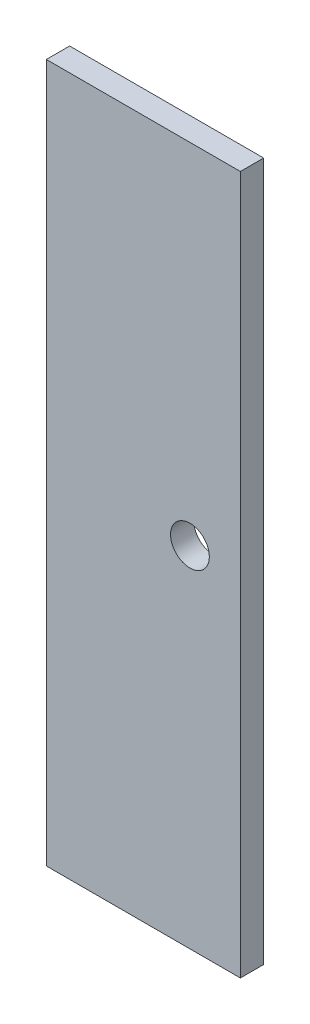
ISO-10303-21;
HEADER;
FILE_DESCRIPTION(('STEP AP214'),'2;1');
FILE_NAME('part.step','',(''),(''),'','','');
FILE_SCHEMA(('AUTOMOTIVE_DESIGN { 1 0 10303 214 1 1 1 1 }'));
ENDSEC;
DATA;
#1=APPLICATION_CONTEXT('core data for automotive mechanical design processes');
#2=APPLICATION_PROTOCOL_DEFINITION('international standard','automotive_design',2000,#1);
#3=PRODUCT_CONTEXT('',#1,'mechanical');
#4=PRODUCT('Part','Part','',(#3));
#5=PRODUCT_RELATED_PRODUCT_CATEGORY('part','',(#4));
#6=PRODUCT_DEFINITION_FORMATION('','',#4);
#7=PRODUCT_DEFINITION_CONTEXT('part definition',#1,'design');
#8=PRODUCT_DEFINITION('design','',#6,#7);
#9=PRODUCT_DEFINITION_SHAPE('','',#8);
#10=(LENGTH_UNIT() NAMED_UNIT(*) SI_UNIT(.MILLI.,.METRE.));
#11=(NAMED_UNIT(*) PLANE_ANGLE_UNIT() SI_UNIT($,.RADIAN.));
#12=(NAMED_UNIT(*) SI_UNIT($,.STERADIAN.) SOLID_ANGLE_UNIT());
#13=UNCERTAINTY_MEASURE_WITH_UNIT(LENGTH_MEASURE(1.E-05),#10,'distance_accuracy_value','');
#14=(GEOMETRIC_REPRESENTATION_CONTEXT(3) GLOBAL_UNCERTAINTY_ASSIGNED_CONTEXT((#13)) GLOBAL_UNIT_ASSIGNED_CONTEXT((#10,
#11,#12)) REPRESENTATION_CONTEXT('',''));
#15=CARTESIAN_POINT('',(0.,0.,0.));
#16=DIRECTION('',(0.,0.,1.));
#17=DIRECTION('',(1.,0.,0.));
#18=AXIS2_PLACEMENT_3D('',#15,#16,#17);
#19=CARTESIAN_POINT('',(-24.9999999999999,-89.9999999999998,6.));
#20=DIRECTION('',(1.,0.,0.));
#21=DIRECTION('',(0.,0.,-1.));
#22=AXIS2_PLACEMENT_3D('',#19,#20,#21);
#23=PLANE('',#22);
#24=DIRECTION('',(0.,-1.,0.));
#25=VECTOR('',#24,1.);
#26=CARTESIAN_POINT('',(-24.9999999999999,-89.9999999999998,0.));
#27=LINE('',#26,#25);
#28=CARTESIAN_POINT('',(-24.9999999999999,90.0000000000002,0.));
#29=VERTEX_POINT('',#28);
#30=CARTESIAN_POINT('',(-24.9999999999999,-89.9999999999998,0.));
#31=VERTEX_POINT('',#30);
#32=EDGE_CURVE('E98',#29,#31,#27,.T.);
#33=ORIENTED_EDGE('',*,*,#32,.T.);
#34=DIRECTION('',(0.,0.,-1.));
#35=VECTOR('',#34,1.);
#36=CARTESIAN_POINT('',(-24.9999999999999,-89.9999999999998,6.));
#37=LINE('',#36,#35);
#38=CARTESIAN_POINT('',(-24.9999999999999,-89.9999999999998,6.));
#39=VERTEX_POINT('',#38);
#40=EDGE_CURVE('E11',#39,#31,#37,.T.);
#41=ORIENTED_EDGE('',*,*,#40,.F.);
#42=DIRECTION('',(0.,-1.,0.));
#43=VECTOR('',#42,1.);
#44=CARTESIAN_POINT('',(-24.9999999999999,-89.9999999999998,6.));
#45=LINE('',#44,#43);
#46=CARTESIAN_POINT('',(-24.9999999999999,90.0000000000002,6.));
#47=VERTEX_POINT('',#46);
#48=EDGE_CURVE('E85',#47,#39,#45,.T.);
#49=ORIENTED_EDGE('',*,*,#48,.F.);
#50=DIRECTION('',(0.,0.,-1.));
#51=VECTOR('',#50,1.);
#52=CARTESIAN_POINT('',(-24.9999999999999,90.0000000000002,6.));
#53=LINE('',#52,#51);
#54=EDGE_CURVE('E94',#47,#29,#53,.T.);
#55=ORIENTED_EDGE('',*,*,#54,.T.);
#56=EDGE_LOOP('',(#33,#41,#49,#55));
#57=FACE_BOUND('',#56,.T.);
#58=ADVANCED_FACE('F33',(#57),#23,.F.);
#59=CARTESIAN_POINT('',(25.0000000000001,-89.9999999999998,6.));
#60=DIRECTION('',(0.,1.,0.));
#61=DIRECTION('',(0.,0.,1.));
#62=AXIS2_PLACEMENT_3D('',#59,#60,#61);
#63=PLANE('',#62);
#64=DIRECTION('',(1.,0.,0.));
#65=VECTOR('',#64,1.);
#66=CARTESIAN_POINT('',(25.0000000000001,-89.9999999999998,0.));
#67=LINE('',#66,#65);
#68=CARTESIAN_POINT('',(25.0000000000001,-89.9999999999998,0.));
#69=VERTEX_POINT('',#68);
#70=EDGE_CURVE('E89',#31,#69,#67,.T.);
#71=ORIENTED_EDGE('',*,*,#70,.T.);
#72=DIRECTION('',(0.,0.,-1.));
#73=VECTOR('',#72,1.);
#74=CARTESIAN_POINT('',(25.0000000000001,-89.9999999999998,6.));
#75=LINE('',#74,#73);
#76=CARTESIAN_POINT('',(25.0000000000001,-89.9999999999998,6.));
#77=VERTEX_POINT('',#76);
#78=EDGE_CURVE('E42',#77,#69,#75,.T.);
#79=ORIENTED_EDGE('',*,*,#78,.F.);
#80=DIRECTION('',(1.,0.,0.));
#81=VECTOR('',#80,1.);
#82=CARTESIAN_POINT('',(25.0000000000001,-89.9999999999998,6.));
#83=LINE('',#82,#81);
#84=EDGE_CURVE('E80',#39,#77,#83,.T.);
#85=ORIENTED_EDGE('',*,*,#84,.F.);
#86=ORIENTED_EDGE('',*,*,#40,.T.);
#87=EDGE_LOOP('',(#71,#79,#85,#86));
#88=FACE_BOUND('',#87,.T.);
#89=ADVANCED_FACE('F88',(#88),#63,.F.);
#90=CARTESIAN_POINT('',(25.0000000000001,-89.9999999999998,6.));
#91=DIRECTION('',(-1.,0.,0.));
#92=DIRECTION('',(0.,0.,1.));
#93=AXIS2_PLACEMENT_3D('',#90,#91,#92);
#94=PLANE('',#93);
#95=DIRECTION('',(0.,1.,0.));
#96=VECTOR('',#95,1.);
#97=CARTESIAN_POINT('',(25.0000000000001,-89.9999999999998,0.));
#98=LINE('',#97,#96);
#99=CARTESIAN_POINT('',(25.0000000000001,90.0000000000002,0.));
#100=VERTEX_POINT('',#99);
#101=EDGE_CURVE('E67',#69,#100,#98,.T.);
#102=ORIENTED_EDGE('',*,*,#101,.T.);
#103=DIRECTION('',(0.,0.,-1.));
#104=VECTOR('',#103,1.);
#105=CARTESIAN_POINT('',(25.0000000000001,90.0000000000002,6.));
#106=LINE('',#105,#104);
#107=CARTESIAN_POINT('',(25.0000000000001,90.0000000000002,6.));
#108=VERTEX_POINT('',#107);
#109=EDGE_CURVE('E90',#108,#100,#106,.T.);
#110=ORIENTED_EDGE('',*,*,#109,.F.);
#111=DIRECTION('',(0.,1.,0.));
#112=VECTOR('',#111,1.);
#113=CARTESIAN_POINT('',(25.0000000000001,-89.9999999999998,6.));
#114=LINE('',#113,#112);
#115=EDGE_CURVE('E83',#77,#108,#114,.T.);
#116=ORIENTED_EDGE('',*,*,#115,.F.);
#117=ORIENTED_EDGE('',*,*,#78,.T.);
#118=EDGE_LOOP('',(#102,#110,#116,#117));
#119=FACE_BOUND('',#118,.T.);
#120=ADVANCED_FACE('F92',(#119),#94,.F.);
#121=CARTESIAN_POINT('',(25.0000000000001,90.0000000000002,6.));
#122=DIRECTION('',(0.,-1.,0.));
#123=DIRECTION('',(0.,0.,-1.));
#124=AXIS2_PLACEMENT_3D('',#121,#122,#123);
#125=PLANE('',#124);
#126=DIRECTION('',(-1.,0.,0.));
#127=VECTOR('',#126,1.);
#128=CARTESIAN_POINT('',(25.0000000000001,90.0000000000002,0.));
#129=LINE('',#128,#127);
#130=EDGE_CURVE('E73',#100,#29,#129,.T.);
#131=ORIENTED_EDGE('',*,*,#130,.T.);
#132=ORIENTED_EDGE('',*,*,#54,.F.);
#133=DIRECTION('',(-1.,0.,0.));
#134=VECTOR('',#133,1.);
#135=CARTESIAN_POINT('',(25.0000000000001,90.0000000000002,6.));
#136=LINE('',#135,#134);
#137=EDGE_CURVE('E50',#108,#47,#136,.T.);
#138=ORIENTED_EDGE('',*,*,#137,.F.);
#139=ORIENTED_EDGE('',*,*,#109,.T.);
#140=EDGE_LOOP('',(#131,#132,#138,#139));
#141=FACE_BOUND('',#140,.T.);
#142=ADVANCED_FACE('F105',(#141),#125,.F.);
#143=CARTESIAN_POINT('',(0.,0.,6.));
#144=DIRECTION('',(0.,0.,1.));
#145=DIRECTION('',(1.,0.,0.));
#146=AXIS2_PLACEMENT_3D('',#143,#144,#145);
#147=PLANE('',#146);
#148=CARTESIAN_POINT('',(12.,0.,6.));
#149=DIRECTION('',(0.,0.,1.));
#150=DIRECTION('',(1.,0.,0.));
#151=AXIS2_PLACEMENT_3D('',#148,#149,#150);
#152=CIRCLE('',#151,5.);
#153=CARTESIAN_POINT('',(17.,0.,6.));
#154=VERTEX_POINT('',#153);
#155=EDGE_CURVE('E111',#154,#154,#152,.T.);
#156=ORIENTED_EDGE('',*,*,#155,.F.);
#157=EDGE_LOOP('',(#156));
#158=FACE_BOUND('',#157,.T.);
#159=ORIENTED_EDGE('',*,*,#48,.T.);
#160=ORIENTED_EDGE('',*,*,#84,.T.);
#161=ORIENTED_EDGE('',*,*,#115,.T.);
#162=ORIENTED_EDGE('',*,*,#137,.T.);
#163=EDGE_LOOP('',(#159,#160,#161,#162));
#164=FACE_BOUND('',#163,.T.);
#165=ADVANCED_FACE('F81',(#158,#164),#147,.T.);
#166=CARTESIAN_POINT('',(0.,0.,0.));
#167=DIRECTION('',(0.,0.,1.));
#168=DIRECTION('',(1.,0.,0.));
#169=AXIS2_PLACEMENT_3D('',#166,#167,#168);
#170=PLANE('',#169);
#171=CARTESIAN_POINT('',(12.,0.,0.));
#172=DIRECTION('',(0.,0.,1.));
#173=DIRECTION('',(1.,0.,0.));
#174=AXIS2_PLACEMENT_3D('',#171,#172,#173);
#175=CIRCLE('',#174,5.);
#176=CARTESIAN_POINT('',(17.,0.,0.));
#177=VERTEX_POINT('',#176);
#178=EDGE_CURVE('E36',#177,#177,#175,.T.);
#179=ORIENTED_EDGE('',*,*,#178,.T.);
#180=EDGE_LOOP('',(#179));
#181=FACE_BOUND('',#180,.T.);
#182=ORIENTED_EDGE('',*,*,#32,.F.);
#183=ORIENTED_EDGE('',*,*,#130,.F.);
#184=ORIENTED_EDGE('',*,*,#101,.F.);
#185=ORIENTED_EDGE('',*,*,#70,.F.);
#186=EDGE_LOOP('',(#182,#183,#184,#185));
#187=FACE_BOUND('',#186,.T.);
#188=ADVANCED_FACE('F108',(#181,#187),#170,.F.);
#189=CARTESIAN_POINT('',(12.,0.,-4.));
#190=DIRECTION('',(0.,0.,1.));
#191=DIRECTION('',(1.,0.,0.));
#192=AXIS2_PLACEMENT_3D('',#189,#190,#191);
#193=CYLINDRICAL_SURFACE('',#192,5.);
#194=ORIENTED_EDGE('',*,*,#155,.T.);
#195=EDGE_LOOP('',(#194));
#196=FACE_BOUND('',#195,.T.);
#197=ORIENTED_EDGE('',*,*,#178,.F.);
#198=EDGE_LOOP('',(#197));
#199=FACE_BOUND('',#198,.T.);
#200=ADVANCED_FACE('F119',(#196,#199),#193,.F.);
#201=CLOSED_SHELL('',(#58,#89,#120,#142,#165,#188,#200));
#202=MANIFOLD_SOLID_BREP('B2',#201);
#203=ADVANCED_BREP_SHAPE_REPRESENTATION('',(#18,#202),#14);
#204=SHAPE_DEFINITION_REPRESENTATION(#9,#203);
ENDSEC;
END-ISO-10303-21;
